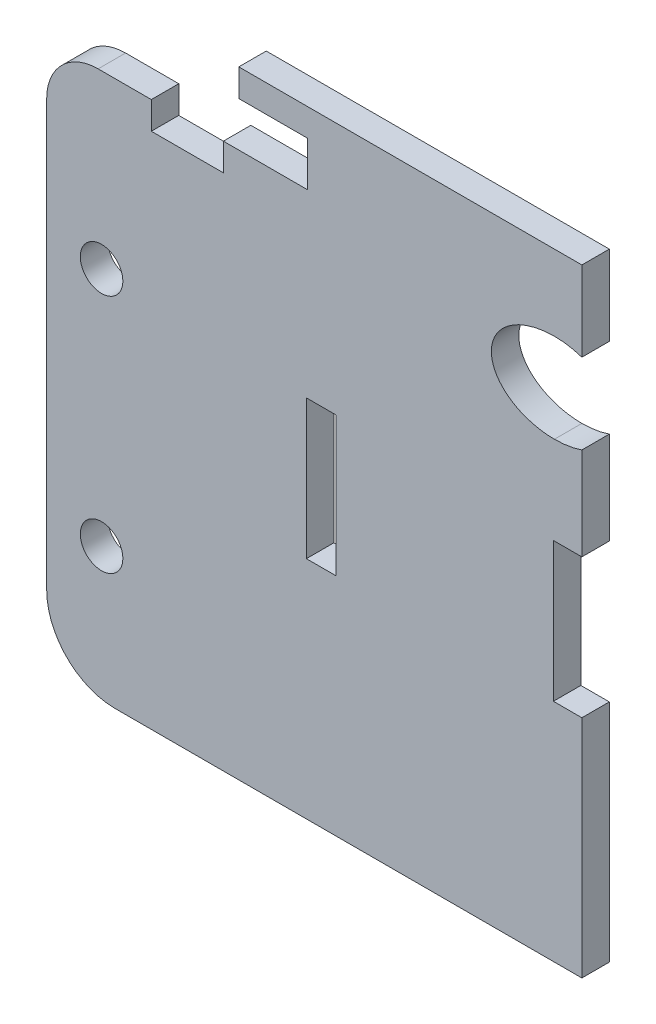
ISO-10303-21;
HEADER;
FILE_DESCRIPTION(('STEP AP214'),'2;1');
FILE_NAME('part.step','',(''),(''),'','','');
FILE_SCHEMA(('AUTOMOTIVE_DESIGN { 1 0 10303 214 1 1 1 1 }'));
ENDSEC;
DATA;
#1=APPLICATION_CONTEXT('core data for automotive mechanical design processes');
#2=APPLICATION_PROTOCOL_DEFINITION('international standard','automotive_design',2000,#1);
#3=PRODUCT_CONTEXT('',#1,'mechanical');
#4=PRODUCT('Part','Part','',(#3));
#5=PRODUCT_RELATED_PRODUCT_CATEGORY('part','',(#4));
#6=PRODUCT_DEFINITION_FORMATION('','',#4);
#7=PRODUCT_DEFINITION_CONTEXT('part definition',#1,'design');
#8=PRODUCT_DEFINITION('design','',#6,#7);
#9=PRODUCT_DEFINITION_SHAPE('','',#8);
#10=(LENGTH_UNIT() NAMED_UNIT(*) SI_UNIT(.MILLI.,.METRE.));
#11=(NAMED_UNIT(*) PLANE_ANGLE_UNIT() SI_UNIT($,.RADIAN.));
#12=(NAMED_UNIT(*) SI_UNIT($,.STERADIAN.) SOLID_ANGLE_UNIT());
#13=UNCERTAINTY_MEASURE_WITH_UNIT(LENGTH_MEASURE(1.E-05),#10,'distance_accuracy_value','');
#14=(GEOMETRIC_REPRESENTATION_CONTEXT(3) GLOBAL_UNCERTAINTY_ASSIGNED_CONTEXT((#13)) GLOBAL_UNIT_ASSIGNED_CONTEXT((#10,
#11,#12)) REPRESENTATION_CONTEXT('',''));
#15=CARTESIAN_POINT('',(0.,0.,0.));
#16=DIRECTION('',(0.,0.,1.));
#17=DIRECTION('',(1.,0.,0.));
#18=AXIS2_PLACEMENT_3D('',#15,#16,#17);
#19=CARTESIAN_POINT('',(36.,-13.,4.));
#20=DIRECTION('',(0.,0.,1.));
#21=DIRECTION('',(1.,0.,0.));
#22=AXIS2_PLACEMENT_3D('',#19,#20,#21);
#23=ELLIPSE('',#22,9.19238815542512,6.5);
#24=DIRECTION('',(0.,0.,1.));
#25=VECTOR('',#24,1.);
#26=SURFACE_OF_LINEAR_EXTRUSION('',#23,#25);
#27=DIRECTION('',(0.,0.,1.));
#28=VECTOR('',#27,1.);
#29=CARTESIAN_POINT('',(36.,-19.5,4.00000000000002));
#30=LINE('',#29,#28);
#31=CARTESIAN_POINT('',(36.,-19.5,0.));
#32=VERTEX_POINT('',#31);
#33=CARTESIAN_POINT('',(36.,-19.5,4.00000000000002));
#34=VERTEX_POINT('',#33);
#35=EDGE_CURVE('E11',#32,#34,#30,.T.);
#36=ORIENTED_EDGE('',*,*,#35,.F.);
#37=CARTESIAN_POINT('',(36.,-13.,0.));
#38=DIRECTION('',(0.,0.,1.));
#39=DIRECTION('',(1.,0.,0.));
#40=AXIS2_PLACEMENT_3D('',#37,#38,#39);
#41=ELLIPSE('',#40,9.19238815542512,6.5);
#42=CARTESIAN_POINT('',(36.,-6.49999999999999,0.));
#43=VERTEX_POINT('',#42);
#44=EDGE_CURVE('E169',#32,#43,#41,.F.);
#45=ORIENTED_EDGE('',*,*,#44,.T.);
#46=DIRECTION('',(0.,0.,1.));
#47=VECTOR('',#46,1.);
#48=CARTESIAN_POINT('',(36.,-6.49999999999999,4.));
#49=LINE('',#48,#47);
#50=CARTESIAN_POINT('',(36.,-6.49999999999999,4.));
#51=VERTEX_POINT('',#50);
#52=EDGE_CURVE('E55',#43,#51,#49,.T.);
#53=ORIENTED_EDGE('',*,*,#52,.T.);
#54=EDGE_CURVE('E341',#34,#51,#23,.F.);
#55=ORIENTED_EDGE('',*,*,#54,.F.);
#56=EDGE_LOOP('',(#36,#45,#53,#55));
#57=FACE_BOUND('',#56,.T.);
#58=ADVANCED_FACE('F45',(#57),#26,.F.);
#59=ORIENTED_EDGE('',*,*,#52,.F.);
#60=CARTESIAN_POINT('',(36.,-13.,0.));
#61=DIRECTION('',(0.,0.,1.));
#62=DIRECTION('',(1.,0.,0.));
#63=AXIS2_PLACEMENT_3D('',#60,#61,#62);
#64=ELLIPSE('',#63,9.19238815542512,6.5);
#65=CARTESIAN_POINT('',(40.,-7.14765004464018,0.));
#66=VERTEX_POINT('',#65);
#67=EDGE_CURVE('E257',#43,#66,#64,.F.);
#68=ORIENTED_EDGE('',*,*,#67,.T.);
#69=DIRECTION('',(0.,0.,1.));
#70=VECTOR('',#69,1.);
#71=CARTESIAN_POINT('',(40.,-7.14765004464018,4.));
#72=LINE('',#71,#70);
#73=CARTESIAN_POINT('',(40.,-7.14765004464018,4.));
#74=VERTEX_POINT('',#73);
#75=EDGE_CURVE('E334',#66,#74,#72,.T.);
#76=ORIENTED_EDGE('',*,*,#75,.T.);
#77=EDGE_CURVE('E351',#51,#74,#23,.F.);
#78=ORIENTED_EDGE('',*,*,#77,.F.);
#79=EDGE_LOOP('',(#59,#68,#76,#78));
#80=FACE_BOUND('',#79,.T.);
#81=ADVANCED_FACE('F355',(#80),#26,.F.);
#82=CARTESIAN_POINT('',(40.,0.,4.));
#83=DIRECTION('',(-1.,0.,0.));
#84=DIRECTION('',(0.,-1.,0.));
#85=AXIS2_PLACEMENT_3D('',#82,#83,#84);
#86=PLANE('',#85);
#87=ORIENTED_EDGE('',*,*,#75,.F.);
#88=DIRECTION('',(0.,1.,0.));
#89=VECTOR('',#88,1.);
#90=CARTESIAN_POINT('',(40.,0.,0.));
#91=LINE('',#90,#89);
#92=CARTESIAN_POINT('',(40.,4.5,0.));
#93=VERTEX_POINT('',#92);
#94=EDGE_CURVE('E253',#93,#66,#91,.F.);
#95=ORIENTED_EDGE('',*,*,#94,.F.);
#96=DIRECTION('',(0.,0.,1.));
#97=VECTOR('',#96,1.);
#98=CARTESIAN_POINT('',(40.,4.5,4.));
#99=LINE('',#98,#97);
#100=CARTESIAN_POINT('',(40.,4.5,4.));
#101=VERTEX_POINT('',#100);
#102=EDGE_CURVE('E331',#93,#101,#99,.T.);
#103=ORIENTED_EDGE('',*,*,#102,.T.);
#104=DIRECTION('',(0.,-1.,0.));
#105=VECTOR('',#104,1.);
#106=CARTESIAN_POINT('',(40.,0.,4.));
#107=LINE('',#106,#105);
#108=EDGE_CURVE('E357',#101,#74,#107,.T.);
#109=ORIENTED_EDGE('',*,*,#108,.T.);
#110=EDGE_LOOP('',(#87,#95,#103,#109));
#111=FACE_BOUND('',#110,.T.);
#112=ADVANCED_FACE('F590',(#111),#86,.F.);
#113=CARTESIAN_POINT('',(0.,4.5,4.));
#114=DIRECTION('',(0.,-1.,0.));
#115=DIRECTION('',(1.,0.,0.));
#116=AXIS2_PLACEMENT_3D('',#113,#114,#115);
#117=PLANE('',#116);
#118=ORIENTED_EDGE('',*,*,#102,.F.);
#119=DIRECTION('',(1.,0.,0.));
#120=VECTOR('',#119,1.);
#121=CARTESIAN_POINT('',(0.,4.5,0.));
#122=LINE('',#121,#120);
#123=CARTESIAN_POINT('',(-10.,4.5,0.));
#124=VERTEX_POINT('',#123);
#125=EDGE_CURVE('E249',#124,#93,#122,.T.);
#126=ORIENTED_EDGE('',*,*,#125,.F.);
#127=DIRECTION('',(0.,0.,1.));
#128=VECTOR('',#127,1.);
#129=CARTESIAN_POINT('',(-10.,4.5,4.));
#130=LINE('',#129,#128);
#131=CARTESIAN_POINT('',(-10.,4.5,4.));
#132=VERTEX_POINT('',#131);
#133=EDGE_CURVE('E328',#124,#132,#130,.T.);
#134=ORIENTED_EDGE('',*,*,#133,.T.);
#135=DIRECTION('',(1.,0.,0.));
#136=VECTOR('',#135,1.);
#137=CARTESIAN_POINT('',(0.,4.5,4.));
#138=LINE('',#137,#136);
#139=EDGE_CURVE('E360',#132,#101,#138,.T.);
#140=ORIENTED_EDGE('',*,*,#139,.T.);
#141=EDGE_LOOP('',(#118,#126,#134,#140));
#142=FACE_BOUND('',#141,.T.);
#143=ADVANCED_FACE('F544',(#142),#117,.F.);
#144=CARTESIAN_POINT('',(-10.,0.,4.));
#145=DIRECTION('',(1.,0.,0.));
#146=DIRECTION('',(0.,1.,0.));
#147=AXIS2_PLACEMENT_3D('',#144,#145,#146);
#148=PLANE('',#147);
#149=ORIENTED_EDGE('',*,*,#133,.F.);
#150=DIRECTION('',(0.,1.,0.));
#151=VECTOR('',#150,1.);
#152=CARTESIAN_POINT('',(-10.,0.,0.));
#153=LINE('',#152,#151);
#154=CARTESIAN_POINT('',(-10.,0.499999999999999,0.));
#155=VERTEX_POINT('',#154);
#156=EDGE_CURVE('E245',#155,#124,#153,.T.);
#157=ORIENTED_EDGE('',*,*,#156,.F.);
#158=DIRECTION('',(0.,0.,1.));
#159=VECTOR('',#158,1.);
#160=CARTESIAN_POINT('',(-10.,0.499999999999999,4.));
#161=LINE('',#160,#159);
#162=CARTESIAN_POINT('',(-10.,0.499999999999999,4.));
#163=VERTEX_POINT('',#162);
#164=EDGE_CURVE('E325',#155,#163,#161,.T.);
#165=ORIENTED_EDGE('',*,*,#164,.T.);
#166=DIRECTION('',(0.,1.,0.));
#167=VECTOR('',#166,1.);
#168=CARTESIAN_POINT('',(-10.,0.,4.));
#169=LINE('',#168,#167);
#170=EDGE_CURVE('E536',#163,#132,#169,.T.);
#171=ORIENTED_EDGE('',*,*,#170,.T.);
#172=EDGE_LOOP('',(#149,#157,#165,#171));
#173=FACE_BOUND('',#172,.T.);
#174=ADVANCED_FACE('F549',(#173),#148,.F.);
#175=CARTESIAN_POINT('',(0.,0.499999999999999,4.));
#176=DIRECTION('',(0.,-1.,0.));
#177=DIRECTION('',(1.,0.,0.));
#178=AXIS2_PLACEMENT_3D('',#175,#176,#177);
#179=PLANE('',#178);
#180=ORIENTED_EDGE('',*,*,#164,.F.);
#181=DIRECTION('',(1.,0.,0.));
#182=VECTOR('',#181,1.);
#183=CARTESIAN_POINT('',(0.,0.499999999999999,0.));
#184=LINE('',#183,#182);
#185=CARTESIAN_POINT('',(0.,0.499999999999999,0.));
#186=VERTEX_POINT('',#185);
#187=EDGE_CURVE('E241',#155,#186,#184,.T.);
#188=ORIENTED_EDGE('',*,*,#187,.T.);
#189=DIRECTION('',(0.,0.,1.));
#190=VECTOR('',#189,1.);
#191=CARTESIAN_POINT('',(0.,0.499999999999999,4.));
#192=LINE('',#191,#190);
#193=CARTESIAN_POINT('',(0.,0.499999999999999,4.));
#194=VERTEX_POINT('',#193);
#195=EDGE_CURVE('E322',#186,#194,#192,.T.);
#196=ORIENTED_EDGE('',*,*,#195,.T.);
#197=DIRECTION('',(1.,0.,0.));
#198=VECTOR('',#197,1.);
#199=CARTESIAN_POINT('',(0.,0.499999999999999,4.));
#200=LINE('',#199,#198);
#201=EDGE_CURVE('E532',#163,#194,#200,.T.);
#202=ORIENTED_EDGE('',*,*,#201,.F.);
#203=EDGE_LOOP('',(#180,#188,#196,#202));
#204=FACE_BOUND('',#203,.T.);
#205=ADVANCED_FACE('F553',(#204),#179,.T.);
#206=CARTESIAN_POINT('',(0.,0.,4.));
#207=DIRECTION('',(-1.,0.,0.));
#208=DIRECTION('',(0.,-1.,0.));
#209=AXIS2_PLACEMENT_3D('',#206,#207,#208);
#210=PLANE('',#209);
#211=ORIENTED_EDGE('',*,*,#195,.F.);
#212=DIRECTION('',(0.,1.,0.));
#213=VECTOR('',#212,1.);
#214=CARTESIAN_POINT('',(0.,0.,0.));
#215=LINE('',#214,#213);
#216=CARTESIAN_POINT('',(0.,-6.00000000000001,0.));
#217=VERTEX_POINT('',#216);
#218=EDGE_CURVE('E237',#186,#217,#215,.F.);
#219=ORIENTED_EDGE('',*,*,#218,.T.);
#220=DIRECTION('',(0.,0.,1.));
#221=VECTOR('',#220,1.);
#222=CARTESIAN_POINT('',(0.,-6.00000000000001,4.));
#223=LINE('',#222,#221);
#224=CARTESIAN_POINT('',(0.,-6.00000000000001,4.));
#225=VERTEX_POINT('',#224);
#226=EDGE_CURVE('E319',#217,#225,#223,.T.);
#227=ORIENTED_EDGE('',*,*,#226,.T.);
#228=DIRECTION('',(0.,-1.,0.));
#229=VECTOR('',#228,1.);
#230=CARTESIAN_POINT('',(0.,0.,4.));
#231=LINE('',#230,#229);
#232=EDGE_CURVE('E528',#194,#225,#231,.T.);
#233=ORIENTED_EDGE('',*,*,#232,.F.);
#234=EDGE_LOOP('',(#211,#219,#227,#233));
#235=FACE_BOUND('',#234,.T.);
#236=ADVANCED_FACE('F557',(#235),#210,.T.);
#237=CARTESIAN_POINT('',(0.,-6.00000000000001,4.));
#238=DIRECTION('',(0.,1.,0.));
#239=DIRECTION('',(-1.,0.,0.));
#240=AXIS2_PLACEMENT_3D('',#237,#238,#239);
#241=PLANE('',#240);
#242=ORIENTED_EDGE('',*,*,#226,.F.);
#243=DIRECTION('',(1.,0.,0.));
#244=VECTOR('',#243,1.);
#245=CARTESIAN_POINT('',(0.,-6.00000000000001,0.));
#246=LINE('',#245,#244);
#247=CARTESIAN_POINT('',(-12.25,-6.,0.));
#248=VERTEX_POINT('',#247);
#249=EDGE_CURVE('E233',#217,#248,#246,.F.);
#250=ORIENTED_EDGE('',*,*,#249,.T.);
#251=DIRECTION('',(0.,0.,1.));
#252=VECTOR('',#251,1.);
#253=CARTESIAN_POINT('',(-12.25,-6.,4.));
#254=LINE('',#253,#252);
#255=CARTESIAN_POINT('',(-12.25,-6.,4.));
#256=VERTEX_POINT('',#255);
#257=EDGE_CURVE('E316',#248,#256,#254,.T.);
#258=ORIENTED_EDGE('',*,*,#257,.T.);
#259=DIRECTION('',(-1.,0.,0.));
#260=VECTOR('',#259,1.);
#261=CARTESIAN_POINT('',(0.,-6.00000000000001,4.));
#262=LINE('',#261,#260);
#263=EDGE_CURVE('E513',#225,#256,#262,.T.);
#264=ORIENTED_EDGE('',*,*,#263,.F.);
#265=EDGE_LOOP('',(#242,#250,#258,#264));
#266=FACE_BOUND('',#265,.T.);
#267=ADVANCED_FACE('F562',(#266),#241,.T.);
#268=CARTESIAN_POINT('',(-12.25,0.,4.));
#269=DIRECTION('',(1.,0.,0.));
#270=DIRECTION('',(0.,1.,0.));
#271=AXIS2_PLACEMENT_3D('',#268,#269,#270);
#272=PLANE('',#271);
#273=ORIENTED_EDGE('',*,*,#257,.F.);
#274=DIRECTION('',(0.,1.,0.));
#275=VECTOR('',#274,1.);
#276=CARTESIAN_POINT('',(-12.25,0.,0.));
#277=LINE('',#276,#275);
#278=CARTESIAN_POINT('',(-12.25,-10.,0.));
#279=VERTEX_POINT('',#278);
#280=EDGE_CURVE('E229',#279,#248,#277,.T.);
#281=ORIENTED_EDGE('',*,*,#280,.F.);
#282=DIRECTION('',(0.,0.,1.));
#283=VECTOR('',#282,1.);
#284=CARTESIAN_POINT('',(-12.25,-10.,4.));
#285=LINE('',#284,#283);
#286=CARTESIAN_POINT('',(-12.25,-10.,4.));
#287=VERTEX_POINT('',#286);
#288=EDGE_CURVE('E313',#279,#287,#285,.T.);
#289=ORIENTED_EDGE('',*,*,#288,.T.);
#290=DIRECTION('',(0.,1.,0.));
#291=VECTOR('',#290,1.);
#292=CARTESIAN_POINT('',(-12.25,0.,4.));
#293=LINE('',#292,#291);
#294=EDGE_CURVE('E522',#287,#256,#293,.T.);
#295=ORIENTED_EDGE('',*,*,#294,.T.);
#296=EDGE_LOOP('',(#273,#281,#289,#295));
#297=FACE_BOUND('',#296,.T.);
#298=ADVANCED_FACE('F565',(#297),#272,.F.);
#299=CARTESIAN_POINT('',(0.,-10.,4.));
#300=DIRECTION('',(0.,-1.,0.));
#301=DIRECTION('',(1.,0.,0.));
#302=AXIS2_PLACEMENT_3D('',#299,#300,#301);
#303=PLANE('',#302);
#304=ORIENTED_EDGE('',*,*,#288,.F.);
#305=DIRECTION('',(1.,0.,0.));
#306=VECTOR('',#305,1.);
#307=CARTESIAN_POINT('',(0.,-10.,0.));
#308=LINE('',#307,#306);
#309=CARTESIAN_POINT('',(-22.75,-10.,0.));
#310=VERTEX_POINT('',#309);
#311=EDGE_CURVE('E225',#310,#279,#308,.T.);
#312=ORIENTED_EDGE('',*,*,#311,.F.);
#313=DIRECTION('',(0.,0.,1.));
#314=VECTOR('',#313,1.);
#315=CARTESIAN_POINT('',(-22.75,-10.,4.));
#316=LINE('',#315,#314);
#317=CARTESIAN_POINT('',(-22.75,-10.,4.));
#318=VERTEX_POINT('',#317);
#319=EDGE_CURVE('E310',#310,#318,#316,.T.);
#320=ORIENTED_EDGE('',*,*,#319,.T.);
#321=DIRECTION('',(1.,0.,0.));
#322=VECTOR('',#321,1.);
#323=CARTESIAN_POINT('',(0.,-10.,4.));
#324=LINE('',#323,#322);
#325=EDGE_CURVE('E518',#318,#287,#324,.T.);
#326=ORIENTED_EDGE('',*,*,#325,.T.);
#327=EDGE_LOOP('',(#304,#312,#320,#326));
#328=FACE_BOUND('',#327,.T.);
#329=ADVANCED_FACE('F570',(#328),#303,.F.);
#330=CARTESIAN_POINT('',(-22.75,0.,4.));
#331=DIRECTION('',(-1.,0.,0.));
#332=DIRECTION('',(0.,-1.,0.));
#333=AXIS2_PLACEMENT_3D('',#330,#331,#332);
#334=PLANE('',#333);
#335=ORIENTED_EDGE('',*,*,#319,.F.);
#336=DIRECTION('',(0.,1.,0.));
#337=VECTOR('',#336,1.);
#338=CARTESIAN_POINT('',(-22.75,0.,0.));
#339=LINE('',#338,#337);
#340=CARTESIAN_POINT('',(-22.75,-6.,0.));
#341=VERTEX_POINT('',#340);
#342=EDGE_CURVE('E221',#341,#310,#339,.F.);
#343=ORIENTED_EDGE('',*,*,#342,.F.);
#344=DIRECTION('',(0.,0.,1.));
#345=VECTOR('',#344,1.);
#346=CARTESIAN_POINT('',(-22.75,-6.,4.));
#347=LINE('',#346,#345);
#348=CARTESIAN_POINT('',(-22.75,-6.,4.));
#349=VERTEX_POINT('',#348);
#350=EDGE_CURVE('E307',#341,#349,#347,.T.);
#351=ORIENTED_EDGE('',*,*,#350,.T.);
#352=DIRECTION('',(0.,-1.,0.));
#353=VECTOR('',#352,1.);
#354=CARTESIAN_POINT('',(-22.75,0.,4.));
#355=LINE('',#354,#353);
#356=EDGE_CURVE('E511',#349,#318,#355,.T.);
#357=ORIENTED_EDGE('',*,*,#356,.T.);
#358=EDGE_LOOP('',(#335,#343,#351,#357));
#359=FACE_BOUND('',#358,.T.);
#360=ADVANCED_FACE('F573',(#359),#334,.F.);
#361=ORIENTED_EDGE('',*,*,#350,.F.);
#362=DIRECTION('',(1.,0.,0.));
#363=VECTOR('',#362,1.);
#364=CARTESIAN_POINT('',(0.,-6.,0.));
#365=LINE('',#364,#363);
#366=CARTESIAN_POINT('',(-30.5,-6.,0.));
#367=VERTEX_POINT('',#366);
#368=EDGE_CURVE('E217',#341,#367,#365,.F.);
#369=ORIENTED_EDGE('',*,*,#368,.T.);
#370=DIRECTION('',(0.,0.,1.));
#371=VECTOR('',#370,1.);
#372=CARTESIAN_POINT('',(-30.5,-6.,4.));
#373=LINE('',#372,#371);
#374=CARTESIAN_POINT('',(-30.5,-6.,4.));
#375=VERTEX_POINT('',#374);
#376=EDGE_CURVE('E304',#367,#375,#373,.T.);
#377=ORIENTED_EDGE('',*,*,#376,.T.);
#378=EDGE_CURVE('E505',#349,#375,#262,.T.);
#379=ORIENTED_EDGE('',*,*,#378,.F.);
#380=EDGE_LOOP('',(#361,#369,#377,#379));
#381=FACE_BOUND('',#380,.T.);
#382=ADVANCED_FACE('F575',(#381),#241,.T.);
#383=CARTESIAN_POINT('',(-30.5,-13.5,4.));
#384=DIRECTION('',(0.,0.,1.));
#385=DIRECTION('',(1.,0.,0.));
#386=AXIS2_PLACEMENT_3D('',#383,#384,#385);
#387=CYLINDRICAL_SURFACE('',#386,7.5);
#388=ORIENTED_EDGE('',*,*,#376,.F.);
#389=CARTESIAN_POINT('',(-30.5,-13.5,0.));
#390=DIRECTION('',(0.,0.,1.));
#391=DIRECTION('',(1.,0.,0.));
#392=AXIS2_PLACEMENT_3D('',#389,#390,#391);
#393=CIRCLE('',#392,7.5);
#394=CARTESIAN_POINT('',(-38.,-13.5,0.));
#395=VERTEX_POINT('',#394);
#396=EDGE_CURVE('E213',#367,#395,#393,.T.);
#397=ORIENTED_EDGE('',*,*,#396,.T.);
#398=DIRECTION('',(0.,0.,1.));
#399=VECTOR('',#398,1.);
#400=CARTESIAN_POINT('',(-38.,-13.5,4.));
#401=LINE('',#400,#399);
#402=CARTESIAN_POINT('',(-38.,-13.5,4.));
#403=VERTEX_POINT('',#402);
#404=EDGE_CURVE('E301',#395,#403,#401,.T.);
#405=ORIENTED_EDGE('',*,*,#404,.T.);
#406=CARTESIAN_POINT('',(-30.5,-13.5,4.));
#407=DIRECTION('',(0.,0.,1.));
#408=DIRECTION('',(1.,0.,0.));
#409=AXIS2_PLACEMENT_3D('',#406,#407,#408);
#410=CIRCLE('',#409,7.5);
#411=EDGE_CURVE('E501',#375,#403,#410,.T.);
#412=ORIENTED_EDGE('',*,*,#411,.F.);
#413=EDGE_LOOP('',(#388,#397,#405,#412));
#414=FACE_BOUND('',#413,.T.);
#415=ADVANCED_FACE('F500',(#414),#387,.T.);
#416=CARTESIAN_POINT('',(-38.,0.,4.));
#417=DIRECTION('',(-1.,0.,0.));
#418=DIRECTION('',(0.,-1.,0.));
#419=AXIS2_PLACEMENT_3D('',#416,#417,#418);
#420=PLANE('',#419);
#421=ORIENTED_EDGE('',*,*,#404,.F.);
#422=DIRECTION('',(0.,1.,0.));
#423=VECTOR('',#422,1.);
#424=CARTESIAN_POINT('',(-38.,0.,0.));
#425=LINE('',#424,#423);
#426=CARTESIAN_POINT('',(-38.,-75.5,0.));
#427=VERTEX_POINT('',#426);
#428=EDGE_CURVE('E209',#395,#427,#425,.F.);
#429=ORIENTED_EDGE('',*,*,#428,.T.);
#430=DIRECTION('',(0.,0.,1.));
#431=VECTOR('',#430,1.);
#432=CARTESIAN_POINT('',(-38.,-75.5,4.));
#433=LINE('',#432,#431);
#434=CARTESIAN_POINT('',(-38.,-75.5,4.));
#435=VERTEX_POINT('',#434);
#436=EDGE_CURVE('E298',#427,#435,#433,.T.);
#437=ORIENTED_EDGE('',*,*,#436,.T.);
#438=DIRECTION('',(0.,-1.,0.));
#439=VECTOR('',#438,1.);
#440=CARTESIAN_POINT('',(-38.,0.,4.));
#441=LINE('',#440,#439);
#442=EDGE_CURVE('E398',#403,#435,#441,.T.);
#443=ORIENTED_EDGE('',*,*,#442,.F.);
#444=EDGE_LOOP('',(#421,#429,#437,#443));
#445=FACE_BOUND('',#444,.T.);
#446=ADVANCED_FACE('F497',(#445),#420,.T.);
#447=CARTESIAN_POINT('',(-28.,-75.5,4.));
#448=DIRECTION('',(0.,0.,1.));
#449=DIRECTION('',(1.,0.,0.));
#450=AXIS2_PLACEMENT_3D('',#447,#448,#449);
#451=CYLINDRICAL_SURFACE('',#450,10.);
#452=ORIENTED_EDGE('',*,*,#436,.F.);
#453=CARTESIAN_POINT('',(-28.,-75.5,0.));
#454=DIRECTION('',(0.,0.,1.));
#455=DIRECTION('',(1.,0.,0.));
#456=AXIS2_PLACEMENT_3D('',#453,#454,#455);
#457=CIRCLE('',#456,10.);
#458=CARTESIAN_POINT('',(-28.,-85.5,0.));
#459=VERTEX_POINT('',#458);
#460=EDGE_CURVE('E205',#427,#459,#457,.T.);
#461=ORIENTED_EDGE('',*,*,#460,.T.);
#462=DIRECTION('',(0.,0.,1.));
#463=VECTOR('',#462,1.);
#464=CARTESIAN_POINT('',(-28.,-85.5,4.));
#465=LINE('',#464,#463);
#466=CARTESIAN_POINT('',(-28.,-85.5,4.));
#467=VERTEX_POINT('',#466);
#468=EDGE_CURVE('E295',#459,#467,#465,.T.);
#469=ORIENTED_EDGE('',*,*,#468,.T.);
#470=CARTESIAN_POINT('',(-28.,-75.5,4.));
#471=DIRECTION('',(0.,0.,1.));
#472=DIRECTION('',(1.,0.,0.));
#473=AXIS2_PLACEMENT_3D('',#470,#471,#472);
#474=CIRCLE('',#473,10.);
#475=EDGE_CURVE('E390',#435,#467,#474,.T.);
#476=ORIENTED_EDGE('',*,*,#475,.F.);
#477=EDGE_LOOP('',(#452,#461,#469,#476));
#478=FACE_BOUND('',#477,.T.);
#479=ADVANCED_FACE('F492',(#478),#451,.T.);
#480=CARTESIAN_POINT('',(0.,-85.5,4.));
#481=DIRECTION('',(0.,1.,0.));
#482=DIRECTION('',(-1.,0.,0.));
#483=AXIS2_PLACEMENT_3D('',#480,#481,#482);
#484=PLANE('',#483);
#485=ORIENTED_EDGE('',*,*,#468,.F.);
#486=DIRECTION('',(1.,0.,0.));
#487=VECTOR('',#486,1.);
#488=CARTESIAN_POINT('',(0.,-85.5,0.));
#489=LINE('',#488,#487);
#490=CARTESIAN_POINT('',(40.,-85.5,0.));
#491=VERTEX_POINT('',#490);
#492=EDGE_CURVE('E201',#491,#459,#489,.F.);
#493=ORIENTED_EDGE('',*,*,#492,.F.);
#494=DIRECTION('',(0.,0.,1.));
#495=VECTOR('',#494,1.);
#496=CARTESIAN_POINT('',(40.,-85.5,4.));
#497=LINE('',#496,#495);
#498=CARTESIAN_POINT('',(40.,-85.5,4.));
#499=VERTEX_POINT('',#498);
#500=EDGE_CURVE('E292',#491,#499,#497,.T.);
#501=ORIENTED_EDGE('',*,*,#500,.T.);
#502=DIRECTION('',(-1.,0.,0.));
#503=VECTOR('',#502,1.);
#504=CARTESIAN_POINT('',(0.,-85.5,4.));
#505=LINE('',#504,#503);
#506=EDGE_CURVE('E379',#499,#467,#505,.T.);
#507=ORIENTED_EDGE('',*,*,#506,.T.);
#508=EDGE_LOOP('',(#485,#493,#501,#507));
#509=FACE_BOUND('',#508,.T.);
#510=ADVANCED_FACE('F486',(#509),#484,.F.);
#511=ORIENTED_EDGE('',*,*,#500,.F.);
#512=DIRECTION('',(0.,1.,0.));
#513=VECTOR('',#512,1.);
#514=CARTESIAN_POINT('',(40.,0.,0.));
#515=LINE('',#514,#513);
#516=CARTESIAN_POINT('',(40.,-52.65,0.));
#517=VERTEX_POINT('',#516);
#518=EDGE_CURVE('E197',#517,#491,#515,.F.);
#519=ORIENTED_EDGE('',*,*,#518,.F.);
#520=DIRECTION('',(0.,0.,1.));
#521=VECTOR('',#520,1.);
#522=CARTESIAN_POINT('',(40.,-52.65,4.));
#523=LINE('',#522,#521);
#524=CARTESIAN_POINT('',(40.,-52.65,4.));
#525=VERTEX_POINT('',#524);
#526=EDGE_CURVE('E289',#517,#525,#523,.T.);
#527=ORIENTED_EDGE('',*,*,#526,.T.);
#528=EDGE_CURVE('E363',#525,#499,#107,.T.);
#529=ORIENTED_EDGE('',*,*,#528,.T.);
#530=EDGE_LOOP('',(#511,#519,#527,#529));
#531=FACE_BOUND('',#530,.T.);
#532=ADVANCED_FACE('F485',(#531),#86,.F.);
#533=CARTESIAN_POINT('',(0.,-52.65,4.));
#534=DIRECTION('',(0.,-1.,0.));
#535=DIRECTION('',(1.,0.,0.));
#536=AXIS2_PLACEMENT_3D('',#533,#534,#535);
#537=PLANE('',#536);
#538=ORIENTED_EDGE('',*,*,#526,.F.);
#539=DIRECTION('',(1.,0.,0.));
#540=VECTOR('',#539,1.);
#541=CARTESIAN_POINT('',(0.,-52.65,0.));
#542=LINE('',#541,#540);
#543=CARTESIAN_POINT('',(35.85,-52.65,0.));
#544=VERTEX_POINT('',#543);
#545=EDGE_CURVE('E193',#544,#517,#542,.T.);
#546=ORIENTED_EDGE('',*,*,#545,.F.);
#547=DIRECTION('',(0.,0.,1.));
#548=VECTOR('',#547,1.);
#549=CARTESIAN_POINT('',(35.85,-52.65,4.));
#550=LINE('',#549,#548);
#551=CARTESIAN_POINT('',(35.85,-52.65,4.));
#552=VERTEX_POINT('',#551);
#553=EDGE_CURVE('E286',#544,#552,#550,.T.);
#554=ORIENTED_EDGE('',*,*,#553,.T.);
#555=DIRECTION('',(1.,0.,0.));
#556=VECTOR('',#555,1.);
#557=CARTESIAN_POINT('',(0.,-52.65,4.));
#558=LINE('',#557,#556);
#559=EDGE_CURVE('E378',#552,#525,#558,.T.);
#560=ORIENTED_EDGE('',*,*,#559,.T.);
#561=EDGE_LOOP('',(#538,#546,#554,#560));
#562=FACE_BOUND('',#561,.T.);
#563=ADVANCED_FACE('F477',(#562),#537,.F.);
#564=CARTESIAN_POINT('',(35.85,0.,4.));
#565=DIRECTION('',(-1.,0.,0.));
#566=DIRECTION('',(0.,-1.,0.));
#567=AXIS2_PLACEMENT_3D('',#564,#565,#566);
#568=PLANE('',#567);
#569=ORIENTED_EDGE('',*,*,#553,.F.);
#570=DIRECTION('',(0.,1.,0.));
#571=VECTOR('',#570,1.);
#572=CARTESIAN_POINT('',(35.85,0.,0.));
#573=LINE('',#572,#571);
#574=CARTESIAN_POINT('',(35.85,-32.35,0.));
#575=VERTEX_POINT('',#574);
#576=EDGE_CURVE('E189',#575,#544,#573,.F.);
#577=ORIENTED_EDGE('',*,*,#576,.F.);
#578=DIRECTION('',(0.,0.,1.));
#579=VECTOR('',#578,1.);
#580=CARTESIAN_POINT('',(35.85,-32.35,4.));
#581=LINE('',#580,#579);
#582=CARTESIAN_POINT('',(35.85,-32.35,4.));
#583=VERTEX_POINT('',#582);
#584=EDGE_CURVE('E284',#575,#583,#581,.T.);
#585=ORIENTED_EDGE('',*,*,#584,.T.);
#586=DIRECTION('',(0.,-1.,0.));
#587=VECTOR('',#586,1.);
#588=CARTESIAN_POINT('',(35.85,0.,4.));
#589=LINE('',#588,#587);
#590=EDGE_CURVE('E387',#583,#552,#589,.T.);
#591=ORIENTED_EDGE('',*,*,#590,.T.);
#592=EDGE_LOOP('',(#569,#577,#585,#591));
#593=FACE_BOUND('',#592,.T.);
#594=ADVANCED_FACE('F481',(#593),#568,.F.);
#595=CARTESIAN_POINT('',(0.,-32.35,4.));
#596=DIRECTION('',(0.,1.,0.));
#597=DIRECTION('',(-1.,0.,0.));
#598=AXIS2_PLACEMENT_3D('',#595,#596,#597);
#599=PLANE('',#598);
#600=ORIENTED_EDGE('',*,*,#584,.F.);
#601=DIRECTION('',(1.,0.,0.));
#602=VECTOR('',#601,1.);
#603=CARTESIAN_POINT('',(0.,-32.35,0.));
#604=LINE('',#603,#602);
#605=CARTESIAN_POINT('',(40.,-32.35,0.));
#606=VERTEX_POINT('',#605);
#607=EDGE_CURVE('E185',#606,#575,#604,.F.);
#608=ORIENTED_EDGE('',*,*,#607,.F.);
#609=DIRECTION('',(0.,0.,1.));
#610=VECTOR('',#609,1.);
#611=CARTESIAN_POINT('',(40.,-32.35,4.));
#612=LINE('',#611,#610);
#613=CARTESIAN_POINT('',(40.,-32.35,4.));
#614=VERTEX_POINT('',#613);
#615=EDGE_CURVE('E63',#606,#614,#612,.T.);
#616=ORIENTED_EDGE('',*,*,#615,.T.);
#617=DIRECTION('',(-1.,0.,0.));
#618=VECTOR('',#617,1.);
#619=CARTESIAN_POINT('',(0.,-32.35,4.));
#620=LINE('',#619,#618);
#621=EDGE_CURVE('E405',#614,#583,#620,.T.);
#622=ORIENTED_EDGE('',*,*,#621,.T.);
#623=EDGE_LOOP('',(#600,#608,#616,#622));
#624=FACE_BOUND('',#623,.T.);
#625=ADVANCED_FACE('F482',(#624),#599,.F.);
#626=ORIENTED_EDGE('',*,*,#615,.F.);
#627=DIRECTION('',(0.,1.,0.));
#628=VECTOR('',#627,1.);
#629=CARTESIAN_POINT('',(40.,0.,0.));
#630=LINE('',#629,#628);
#631=CARTESIAN_POINT('',(40.,-18.8523499553598,0.));
#632=VERTEX_POINT('',#631);
#633=EDGE_CURVE('E167',#632,#606,#630,.F.);
#634=ORIENTED_EDGE('',*,*,#633,.F.);
#635=DIRECTION('',(0.,0.,1.));
#636=VECTOR('',#635,1.);
#637=CARTESIAN_POINT('',(40.,-18.8523499553598,4.));
#638=LINE('',#637,#636);
#639=CARTESIAN_POINT('',(40.,-18.8523499553598,4.));
#640=VERTEX_POINT('',#639);
#641=EDGE_CURVE('E49',#632,#640,#638,.T.);
#642=ORIENTED_EDGE('',*,*,#641,.T.);
#643=EDGE_CURVE('E362',#640,#614,#107,.T.);
#644=ORIENTED_EDGE('',*,*,#643,.T.);
#645=EDGE_LOOP('',(#626,#634,#642,#644));
#646=FACE_BOUND('',#645,.T.);
#647=ADVANCED_FACE('F172',(#646),#86,.F.);
#648=CARTESIAN_POINT('',(-0.149999999999996,0.,4.));
#649=DIRECTION('',(-1.,0.,0.));
#650=DIRECTION('',(0.,-1.,0.));
#651=AXIS2_PLACEMENT_3D('',#648,#649,#650);
#652=PLANE('',#651);
#653=DIRECTION('',(0.,0.,1.));
#654=VECTOR('',#653,1.);
#655=CARTESIAN_POINT('',(-0.150000000000003,-52.65,4.));
#656=LINE('',#655,#654);
#657=CARTESIAN_POINT('',(-0.150000000000003,-52.65,0.));
#658=VERTEX_POINT('',#657);
#659=CARTESIAN_POINT('',(-0.150000000000003,-52.65,4.));
#660=VERTEX_POINT('',#659);
#661=EDGE_CURVE('E161',#658,#660,#656,.T.);
#662=ORIENTED_EDGE('',*,*,#661,.F.);
#663=DIRECTION('',(0.,1.,0.));
#664=VECTOR('',#663,1.);
#665=CARTESIAN_POINT('',(-0.15,0.,0.));
#666=LINE('',#665,#664);
#667=CARTESIAN_POINT('',(-0.15,-32.35,0.));
#668=VERTEX_POINT('',#667);
#669=EDGE_CURVE('E179',#668,#658,#666,.F.);
#670=ORIENTED_EDGE('',*,*,#669,.F.);
#671=DIRECTION('',(0.,0.,1.));
#672=VECTOR('',#671,1.);
#673=CARTESIAN_POINT('',(-0.15,-32.35,4.));
#674=LINE('',#673,#672);
#675=CARTESIAN_POINT('',(-0.15,-32.35,4.));
#676=VERTEX_POINT('',#675);
#677=EDGE_CURVE('E274',#668,#676,#674,.T.);
#678=ORIENTED_EDGE('',*,*,#677,.T.);
#679=DIRECTION('',(0.,-1.,0.));
#680=VECTOR('',#679,1.);
#681=CARTESIAN_POINT('',(-0.149999999999996,0.,4.));
#682=LINE('',#681,#680);
#683=EDGE_CURVE('E374',#676,#660,#682,.T.);
#684=ORIENTED_EDGE('',*,*,#683,.T.);
#685=EDGE_LOOP('',(#662,#670,#678,#684));
#686=FACE_BOUND('',#685,.T.);
#687=ADVANCED_FACE('F607',(#686),#652,.F.);
#688=CARTESIAN_POINT('',(0.,-32.35,4.));
#689=DIRECTION('',(0.,1.,0.));
#690=DIRECTION('',(-1.,0.,0.));
#691=AXIS2_PLACEMENT_3D('',#688,#689,#690);
#692=PLANE('',#691);
#693=ORIENTED_EDGE('',*,*,#677,.F.);
#694=DIRECTION('',(1.,0.,0.));
#695=VECTOR('',#694,1.);
#696=CARTESIAN_POINT('',(0.,-32.35,0.));
#697=LINE('',#696,#695);
#698=CARTESIAN_POINT('',(4.15,-32.35,0.));
#699=VERTEX_POINT('',#698);
#700=EDGE_CURVE('E174',#699,#668,#697,.F.);
#701=ORIENTED_EDGE('',*,*,#700,.F.);
#702=DIRECTION('',(0.,0.,1.));
#703=VECTOR('',#702,1.);
#704=CARTESIAN_POINT('',(4.15,-32.35,4.));
#705=LINE('',#704,#703);
#706=CARTESIAN_POINT('',(4.15,-32.35,4.));
#707=VERTEX_POINT('',#706);
#708=EDGE_CURVE('E271',#699,#707,#705,.T.);
#709=ORIENTED_EDGE('',*,*,#708,.T.);
#710=DIRECTION('',(-1.,0.,0.));
#711=VECTOR('',#710,1.);
#712=CARTESIAN_POINT('',(0.,-32.35,4.));
#713=LINE('',#712,#711);
#714=EDGE_CURVE('E369',#707,#676,#713,.T.);
#715=ORIENTED_EDGE('',*,*,#714,.T.);
#716=EDGE_LOOP('',(#693,#701,#709,#715));
#717=FACE_BOUND('',#716,.T.);
#718=ADVANCED_FACE('F437',(#717),#692,.F.);
#719=CARTESIAN_POINT('',(4.15000000000001,0.,4.));
#720=DIRECTION('',(1.,0.,0.));
#721=DIRECTION('',(0.,1.,0.));
#722=AXIS2_PLACEMENT_3D('',#719,#720,#721);
#723=PLANE('',#722);
#724=ORIENTED_EDGE('',*,*,#708,.F.);
#725=DIRECTION('',(0.,1.,0.));
#726=VECTOR('',#725,1.);
#727=CARTESIAN_POINT('',(4.15,0.,0.));
#728=LINE('',#727,#726);
#729=CARTESIAN_POINT('',(4.15,-52.65,0.));
#730=VERTEX_POINT('',#729);
#731=EDGE_CURVE('E415',#730,#699,#728,.T.);
#732=ORIENTED_EDGE('',*,*,#731,.F.);
#733=DIRECTION('',(0.,0.,1.));
#734=VECTOR('',#733,1.);
#735=CARTESIAN_POINT('',(4.15,-52.65,4.));
#736=LINE('',#735,#734);
#737=CARTESIAN_POINT('',(4.15,-52.65,4.));
#738=VERTEX_POINT('',#737);
#739=EDGE_CURVE('E275',#730,#738,#736,.T.);
#740=ORIENTED_EDGE('',*,*,#739,.T.);
#741=DIRECTION('',(0.,1.,0.));
#742=VECTOR('',#741,1.);
#743=CARTESIAN_POINT('',(4.15000000000001,0.,4.));
#744=LINE('',#743,#742);
#745=EDGE_CURVE('E270',#738,#707,#744,.T.);
#746=ORIENTED_EDGE('',*,*,#745,.T.);
#747=EDGE_LOOP('',(#724,#732,#740,#746));
#748=FACE_BOUND('',#747,.T.);
#749=ADVANCED_FACE('F431',(#748),#723,.F.);
#750=CARTESIAN_POINT('',(0.,-52.65,4.));
#751=DIRECTION('',(0.,-1.,0.));
#752=DIRECTION('',(1.,0.,0.));
#753=AXIS2_PLACEMENT_3D('',#750,#751,#752);
#754=PLANE('',#753);
#755=DIRECTION('',(1.,0.,0.));
#756=VECTOR('',#755,1.);
#757=CARTESIAN_POINT('',(0.,-52.65,0.));
#758=LINE('',#757,#756);
#759=EDGE_CURVE('E183',#658,#730,#758,.T.);
#760=ORIENTED_EDGE('',*,*,#759,.F.);
#761=ORIENTED_EDGE('',*,*,#661,.T.);
#762=DIRECTION('',(1.,0.,0.));
#763=VECTOR('',#762,1.);
#764=CARTESIAN_POINT('',(0.,-52.65,4.));
#765=LINE('',#764,#763);
#766=EDGE_CURVE('E970',#660,#738,#765,.T.);
#767=ORIENTED_EDGE('',*,*,#766,.T.);
#768=ORIENTED_EDGE('',*,*,#739,.F.);
#769=EDGE_LOOP('',(#760,#761,#767,#768));
#770=FACE_BOUND('',#769,.T.);
#771=ADVANCED_FACE('F594',(#770),#754,.F.);
#772=CARTESIAN_POINT('',(36.,-13.,0.));
#773=DIRECTION('',(0.,0.,1.));
#774=DIRECTION('',(1.,0.,0.));
#775=AXIS2_PLACEMENT_3D('',#772,#773,#774);
#776=ELLIPSE('',#775,9.19238815542512,6.5);
#777=EDGE_CURVE('E154',#632,#32,#776,.F.);
#778=ORIENTED_EDGE('',*,*,#777,.T.);
#779=ORIENTED_EDGE('',*,*,#35,.T.);
#780=EDGE_CURVE('E157',#640,#34,#23,.F.);
#781=ORIENTED_EDGE('',*,*,#780,.F.);
#782=ORIENTED_EDGE('',*,*,#641,.F.);
#783=EDGE_LOOP('',(#778,#779,#781,#782));
#784=FACE_BOUND('',#783,.T.);
#785=ADVANCED_FACE('F153',(#784),#26,.F.);
#786=CARTESIAN_POINT('',(-30.,-66.,4.));
#787=DIRECTION('',(0.,0.,1.));
#788=DIRECTION('',(1.,0.,0.));
#789=AXIS2_PLACEMENT_3D('',#786,#787,#788);
#790=CYLINDRICAL_SURFACE('',#789,3.1);
#791=CARTESIAN_POINT('',(-30.,-66.,4.));
#792=DIRECTION('',(0.,0.,1.));
#793=DIRECTION('',(1.,0.,0.));
#794=AXIS2_PLACEMENT_3D('',#791,#792,#793);
#795=CIRCLE('',#794,3.1);
#796=CARTESIAN_POINT('',(-26.9,-66.,4.));
#797=VERTEX_POINT('',#796);
#798=EDGE_CURVE('E408',#797,#797,#795,.T.);
#799=ORIENTED_EDGE('',*,*,#798,.T.);
#800=EDGE_LOOP('',(#799));
#801=FACE_BOUND('',#800,.T.);
#802=CARTESIAN_POINT('',(-30.,-66.,0.));
#803=DIRECTION('',(0.,0.,1.));
#804=DIRECTION('',(1.,0.,0.));
#805=AXIS2_PLACEMENT_3D('',#802,#803,#804);
#806=CIRCLE('',#805,3.1);
#807=CARTESIAN_POINT('',(-26.9,-66.,0.));
#808=VERTEX_POINT('',#807);
#809=EDGE_CURVE('E188',#808,#808,#806,.T.);
#810=ORIENTED_EDGE('',*,*,#809,.F.);
#811=EDGE_LOOP('',(#810));
#812=FACE_BOUND('',#811,.T.);
#813=ADVANCED_FACE('F593',(#801,#812),#790,.F.);
#814=CARTESIAN_POINT('',(-30.,-31.,4.));
#815=DIRECTION('',(0.,0.,1.));
#816=DIRECTION('',(1.,0.,0.));
#817=AXIS2_PLACEMENT_3D('',#814,#815,#816);
#818=CYLINDRICAL_SURFACE('',#817,3.1);
#819=CARTESIAN_POINT('',(-30.,-31.,4.));
#820=DIRECTION('',(0.,0.,1.));
#821=DIRECTION('',(1.,0.,0.));
#822=AXIS2_PLACEMENT_3D('',#819,#820,#821);
#823=CIRCLE('',#822,3.1);
#824=CARTESIAN_POINT('',(-26.9,-31.,4.));
#825=VERTEX_POINT('',#824);
#826=EDGE_CURVE('E282',#825,#825,#823,.T.);
#827=ORIENTED_EDGE('',*,*,#826,.T.);
#828=EDGE_LOOP('',(#827));
#829=FACE_BOUND('',#828,.T.);
#830=CARTESIAN_POINT('',(-30.,-31.,0.));
#831=DIRECTION('',(0.,0.,1.));
#832=DIRECTION('',(1.,0.,0.));
#833=AXIS2_PLACEMENT_3D('',#830,#831,#832);
#834=CIRCLE('',#833,3.1);
#835=CARTESIAN_POINT('',(-26.9,-31.,0.));
#836=VERTEX_POINT('',#835);
#837=EDGE_CURVE('E266',#836,#836,#834,.T.);
#838=ORIENTED_EDGE('',*,*,#837,.F.);
#839=EDGE_LOOP('',(#838));
#840=FACE_BOUND('',#839,.T.);
#841=ADVANCED_FACE('F47',(#829,#840),#818,.F.);
#842=CARTESIAN_POINT('',(0.,0.,4.));
#843=DIRECTION('',(0.,0.,1.));
#844=DIRECTION('',(1.,0.,0.));
#845=AXIS2_PLACEMENT_3D('',#842,#843,#844);
#846=PLANE('',#845);
#847=ORIENTED_EDGE('',*,*,#745,.F.);
#848=ORIENTED_EDGE('',*,*,#766,.F.);
#849=ORIENTED_EDGE('',*,*,#683,.F.);
#850=ORIENTED_EDGE('',*,*,#714,.F.);
#851=EDGE_LOOP('',(#847,#848,#849,#850));
#852=FACE_BOUND('',#851,.T.);
#853=ORIENTED_EDGE('',*,*,#643,.F.);
#854=ORIENTED_EDGE('',*,*,#780,.T.);
#855=ORIENTED_EDGE('',*,*,#54,.T.);
#856=ORIENTED_EDGE('',*,*,#77,.T.);
#857=ORIENTED_EDGE('',*,*,#108,.F.);
#858=ORIENTED_EDGE('',*,*,#139,.F.);
#859=ORIENTED_EDGE('',*,*,#170,.F.);
#860=ORIENTED_EDGE('',*,*,#201,.T.);
#861=ORIENTED_EDGE('',*,*,#232,.T.);
#862=ORIENTED_EDGE('',*,*,#263,.T.);
#863=ORIENTED_EDGE('',*,*,#294,.F.);
#864=ORIENTED_EDGE('',*,*,#325,.F.);
#865=ORIENTED_EDGE('',*,*,#356,.F.);
#866=ORIENTED_EDGE('',*,*,#378,.T.);
#867=ORIENTED_EDGE('',*,*,#411,.T.);
#868=ORIENTED_EDGE('',*,*,#442,.T.);
#869=ORIENTED_EDGE('',*,*,#475,.T.);
#870=ORIENTED_EDGE('',*,*,#506,.F.);
#871=ORIENTED_EDGE('',*,*,#528,.F.);
#872=ORIENTED_EDGE('',*,*,#559,.F.);
#873=ORIENTED_EDGE('',*,*,#590,.F.);
#874=ORIENTED_EDGE('',*,*,#621,.F.);
#875=EDGE_LOOP('',(#853,#854,#855,#856,#857,#858,#859,#860,#861,#862,#863,#864,#865,#866,#867,
#868,#869,#870,#871,#872,#873,#874));
#876=FACE_BOUND('',#875,.T.);
#877=ORIENTED_EDGE('',*,*,#798,.F.);
#878=EDGE_LOOP('',(#877));
#879=FACE_BOUND('',#878,.T.);
#880=ORIENTED_EDGE('',*,*,#826,.F.);
#881=EDGE_LOOP('',(#880));
#882=FACE_BOUND('',#881,.T.);
#883=ADVANCED_FACE('F348',(#852,#876,#879,#882),#846,.T.);
#884=CARTESIAN_POINT('',(0.,0.,0.));
#885=DIRECTION('',(0.,0.,1.));
#886=DIRECTION('',(1.,0.,0.));
#887=AXIS2_PLACEMENT_3D('',#884,#885,#886);
#888=PLANE('',#887);
#889=ORIENTED_EDGE('',*,*,#731,.T.);
#890=ORIENTED_EDGE('',*,*,#700,.T.);
#891=ORIENTED_EDGE('',*,*,#669,.T.);
#892=ORIENTED_EDGE('',*,*,#759,.T.);
#893=EDGE_LOOP('',(#889,#890,#891,#892));
#894=FACE_BOUND('',#893,.T.);
#895=ORIENTED_EDGE('',*,*,#633,.T.);
#896=ORIENTED_EDGE('',*,*,#607,.T.);
#897=ORIENTED_EDGE('',*,*,#576,.T.);
#898=ORIENTED_EDGE('',*,*,#545,.T.);
#899=ORIENTED_EDGE('',*,*,#518,.T.);
#900=ORIENTED_EDGE('',*,*,#492,.T.);
#901=ORIENTED_EDGE('',*,*,#460,.F.);
#902=ORIENTED_EDGE('',*,*,#428,.F.);
#903=ORIENTED_EDGE('',*,*,#396,.F.);
#904=ORIENTED_EDGE('',*,*,#368,.F.);
#905=ORIENTED_EDGE('',*,*,#342,.T.);
#906=ORIENTED_EDGE('',*,*,#311,.T.);
#907=ORIENTED_EDGE('',*,*,#280,.T.);
#908=ORIENTED_EDGE('',*,*,#249,.F.);
#909=ORIENTED_EDGE('',*,*,#218,.F.);
#910=ORIENTED_EDGE('',*,*,#187,.F.);
#911=ORIENTED_EDGE('',*,*,#156,.T.);
#912=ORIENTED_EDGE('',*,*,#125,.T.);
#913=ORIENTED_EDGE('',*,*,#94,.T.);
#914=ORIENTED_EDGE('',*,*,#67,.F.);
#915=ORIENTED_EDGE('',*,*,#44,.F.);
#916=ORIENTED_EDGE('',*,*,#777,.F.);
#917=EDGE_LOOP('',(#895,#896,#897,#898,#899,#900,#901,#902,#903,#904,#905,#906,#907,#908,#909,
#910,#911,#912,#913,#914,#915,#916));
#918=FACE_BOUND('',#917,.T.);
#919=ORIENTED_EDGE('',*,*,#809,.T.);
#920=EDGE_LOOP('',(#919));
#921=FACE_BOUND('',#920,.T.);
#922=ORIENTED_EDGE('',*,*,#837,.T.);
#923=EDGE_LOOP('',(#922));
#924=FACE_BOUND('',#923,.T.);
#925=ADVANCED_FACE('F164',(#894,#918,#921,#924),#888,.F.);
#926=CLOSED_SHELL('',(#58,#81,#112,#143,#174,#205,#236,#267,#298,#329,#360,#382,#415,#446,#479,
#510,#532,#563,#594,#625,#647,#687,#718,#749,#771,#785,#813,#841,#883,#925));
#927=MANIFOLD_SOLID_BREP('B2',#926);
#928=ADVANCED_BREP_SHAPE_REPRESENTATION('',(#18,#927),#14);
#929=SHAPE_DEFINITION_REPRESENTATION(#9,#928);
ENDSEC;
END-ISO-10303-21;
